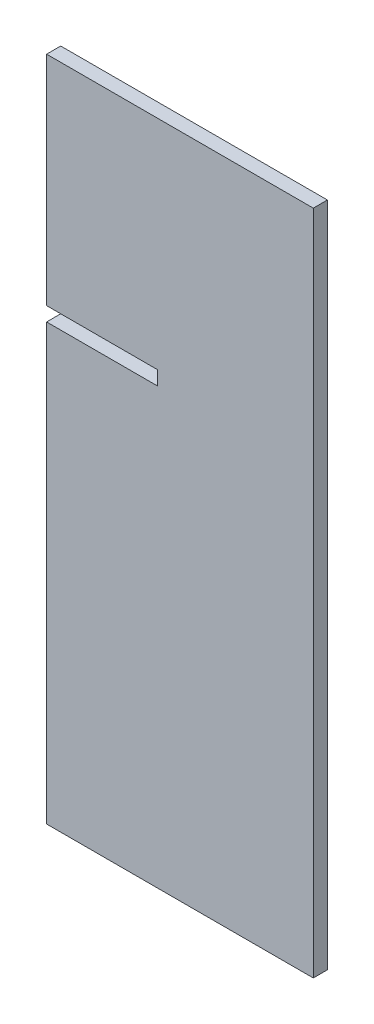
ISO-10303-21;
HEADER;
FILE_DESCRIPTION(('STEP AP214'),'2;1');
FILE_NAME('part.step','',(''),(''),'','','');
FILE_SCHEMA(('AUTOMOTIVE_DESIGN { 1 0 10303 214 1 1 1 1 }'));
ENDSEC;
DATA;
#1=APPLICATION_CONTEXT('core data for automotive mechanical design processes');
#2=APPLICATION_PROTOCOL_DEFINITION('international standard','automotive_design',2000,#1);
#3=PRODUCT_CONTEXT('',#1,'mechanical');
#4=PRODUCT('Part','Part','',(#3));
#5=PRODUCT_RELATED_PRODUCT_CATEGORY('part','',(#4));
#6=PRODUCT_DEFINITION_FORMATION('','',#4);
#7=PRODUCT_DEFINITION_CONTEXT('part definition',#1,'design');
#8=PRODUCT_DEFINITION('design','',#6,#7);
#9=PRODUCT_DEFINITION_SHAPE('','',#8);
#10=(LENGTH_UNIT() NAMED_UNIT(*) SI_UNIT(.MILLI.,.METRE.));
#11=(NAMED_UNIT(*) PLANE_ANGLE_UNIT() SI_UNIT($,.RADIAN.));
#12=(NAMED_UNIT(*) SI_UNIT($,.STERADIAN.) SOLID_ANGLE_UNIT());
#13=UNCERTAINTY_MEASURE_WITH_UNIT(LENGTH_MEASURE(1.E-05),#10,'distance_accuracy_value','');
#14=(GEOMETRIC_REPRESENTATION_CONTEXT(3) GLOBAL_UNCERTAINTY_ASSIGNED_CONTEXT((#13)) GLOBAL_UNIT_ASSIGNED_CONTEXT((#10,
#11,#12)) REPRESENTATION_CONTEXT('',''));
#15=CARTESIAN_POINT('',(0.,0.,0.));
#16=DIRECTION('',(0.,0.,1.));
#17=DIRECTION('',(1.,0.,0.));
#18=AXIS2_PLACEMENT_3D('',#15,#16,#17);
#19=CARTESIAN_POINT('',(-30.,75.,3.175));
#20=DIRECTION('',(1.,0.,0.));
#21=DIRECTION('',(0.,1.,0.));
#22=AXIS2_PLACEMENT_3D('',#19,#20,#21);
#23=PLANE('',#22);
#24=DIRECTION('',(0.,-1.,0.));
#25=VECTOR('',#24,1.);
#26=CARTESIAN_POINT('',(-30.,75.,0.));
#27=LINE('',#26,#25);
#28=CARTESIAN_POINT('',(-30.,75.,0.));
#29=VERTEX_POINT('',#28);
#30=CARTESIAN_POINT('',(-30.,26.,0.));
#31=VERTEX_POINT('',#30);
#32=EDGE_CURVE('E131',#29,#31,#27,.T.);
#33=ORIENTED_EDGE('',*,*,#32,.T.);
#34=DIRECTION('',(0.,0.,1.));
#35=VECTOR('',#34,1.);
#36=CARTESIAN_POINT('',(-30.,26.,0.));
#37=LINE('',#36,#35);
#38=CARTESIAN_POINT('',(-30.,26.,3.175));
#39=VERTEX_POINT('',#38);
#40=EDGE_CURVE('E163',#31,#39,#37,.T.);
#41=ORIENTED_EDGE('',*,*,#40,.T.);
#42=DIRECTION('',(0.,-1.,0.));
#43=VECTOR('',#42,1.);
#44=CARTESIAN_POINT('',(-30.,75.,3.175));
#45=LINE('',#44,#43);
#46=CARTESIAN_POINT('',(-30.,75.,3.175));
#47=VERTEX_POINT('',#46);
#48=EDGE_CURVE('E150',#47,#39,#45,.T.);
#49=ORIENTED_EDGE('',*,*,#48,.F.);
#50=DIRECTION('',(0.,0.,-1.));
#51=VECTOR('',#50,1.);
#52=CARTESIAN_POINT('',(-30.,75.,3.175));
#53=LINE('',#52,#51);
#54=EDGE_CURVE('E45',#47,#29,#53,.T.);
#55=ORIENTED_EDGE('',*,*,#54,.T.);
#56=EDGE_LOOP('',(#33,#41,#49,#55));
#57=FACE_BOUND('',#56,.T.);
#58=ADVANCED_FACE('F37',(#57),#23,.F.);
#59=CARTESIAN_POINT('',(30.,75.,3.175));
#60=DIRECTION('',(-1.,0.,0.));
#61=DIRECTION('',(0.,-1.,0.));
#62=AXIS2_PLACEMENT_3D('',#59,#60,#61);
#63=PLANE('',#62);
#64=DIRECTION('',(0.,1.,0.));
#65=VECTOR('',#64,1.);
#66=CARTESIAN_POINT('',(30.,75.,0.));
#67=LINE('',#66,#65);
#68=CARTESIAN_POINT('',(30.,-75.,0.));
#69=VERTEX_POINT('',#68);
#70=CARTESIAN_POINT('',(30.,75.,0.));
#71=VERTEX_POINT('',#70);
#72=EDGE_CURVE('E135',#69,#71,#67,.T.);
#73=ORIENTED_EDGE('',*,*,#72,.T.);
#74=DIRECTION('',(0.,0.,-1.));
#75=VECTOR('',#74,1.);
#76=CARTESIAN_POINT('',(30.,75.,3.175));
#77=LINE('',#76,#75);
#78=CARTESIAN_POINT('',(30.,75.,3.175));
#79=VERTEX_POINT('',#78);
#80=EDGE_CURVE('E11',#79,#71,#77,.T.);
#81=ORIENTED_EDGE('',*,*,#80,.F.);
#82=DIRECTION('',(0.,1.,0.));
#83=VECTOR('',#82,1.);
#84=CARTESIAN_POINT('',(30.,75.,3.175));
#85=LINE('',#84,#83);
#86=CARTESIAN_POINT('',(30.,-75.,3.175));
#87=VERTEX_POINT('',#86);
#88=EDGE_CURVE('E140',#87,#79,#85,.T.);
#89=ORIENTED_EDGE('',*,*,#88,.F.);
#90=DIRECTION('',(0.,0.,-1.));
#91=VECTOR('',#90,1.);
#92=CARTESIAN_POINT('',(30.,-75.,3.175));
#93=LINE('',#92,#91);
#94=EDGE_CURVE('E141',#87,#69,#93,.T.);
#95=ORIENTED_EDGE('',*,*,#94,.T.);
#96=EDGE_LOOP('',(#73,#81,#89,#95));
#97=FACE_BOUND('',#96,.T.);
#98=ADVANCED_FACE('F39',(#97),#63,.F.);
#99=CARTESIAN_POINT('',(-30.,75.,3.175));
#100=DIRECTION('',(0.,-1.,0.));
#101=DIRECTION('',(0.,0.,-1.));
#102=AXIS2_PLACEMENT_3D('',#99,#100,#101);
#103=PLANE('',#102);
#104=DIRECTION('',(-1.,0.,0.));
#105=VECTOR('',#104,1.);
#106=CARTESIAN_POINT('',(-30.,75.,0.));
#107=LINE('',#106,#105);
#108=EDGE_CURVE('E132',#71,#29,#107,.T.);
#109=ORIENTED_EDGE('',*,*,#108,.T.);
#110=ORIENTED_EDGE('',*,*,#54,.F.);
#111=DIRECTION('',(-1.,0.,0.));
#112=VECTOR('',#111,1.);
#113=CARTESIAN_POINT('',(-30.,75.,3.175));
#114=LINE('',#113,#112);
#115=EDGE_CURVE('E89',#79,#47,#114,.T.);
#116=ORIENTED_EDGE('',*,*,#115,.F.);
#117=ORIENTED_EDGE('',*,*,#80,.T.);
#118=EDGE_LOOP('',(#109,#110,#116,#117));
#119=FACE_BOUND('',#118,.T.);
#120=ADVANCED_FACE('F184',(#119),#103,.F.);
#121=CARTESIAN_POINT('',(-30.,22.825,3.175));
#122=VERTEX_POINT('',#121);
#123=CARTESIAN_POINT('',(-30.,-75.,3.175));
#124=VERTEX_POINT('',#123);
#125=EDGE_CURVE('E126',#122,#124,#45,.T.);
#126=ORIENTED_EDGE('',*,*,#125,.F.);
#127=DIRECTION('',(0.,0.,1.));
#128=VECTOR('',#127,1.);
#129=CARTESIAN_POINT('',(-30.,22.825,0.));
#130=LINE('',#129,#128);
#131=CARTESIAN_POINT('',(-30.,22.825,0.));
#132=VERTEX_POINT('',#131);
#133=EDGE_CURVE('E114',#132,#122,#130,.T.);
#134=ORIENTED_EDGE('',*,*,#133,.F.);
#135=CARTESIAN_POINT('',(-30.,-75.,0.));
#136=VERTEX_POINT('',#135);
#137=EDGE_CURVE('E125',#132,#136,#27,.T.);
#138=ORIENTED_EDGE('',*,*,#137,.T.);
#139=DIRECTION('',(0.,0.,-1.));
#140=VECTOR('',#139,1.);
#141=CARTESIAN_POINT('',(-30.,-75.,3.175));
#142=LINE('',#141,#140);
#143=EDGE_CURVE('E143',#124,#136,#142,.T.);
#144=ORIENTED_EDGE('',*,*,#143,.F.);
#145=EDGE_LOOP('',(#126,#134,#138,#144));
#146=FACE_BOUND('',#145,.T.);
#147=ADVANCED_FACE('F123',(#146),#23,.F.);
#148=CARTESIAN_POINT('',(-30.,-75.,3.175));
#149=DIRECTION('',(0.,1.,0.));
#150=DIRECTION('',(0.,0.,1.));
#151=AXIS2_PLACEMENT_3D('',#148,#149,#150);
#152=PLANE('',#151);
#153=DIRECTION('',(1.,0.,0.));
#154=VECTOR('',#153,1.);
#155=CARTESIAN_POINT('',(-30.,-75.,0.));
#156=LINE('',#155,#154);
#157=EDGE_CURVE('E82',#136,#69,#156,.T.);
#158=ORIENTED_EDGE('',*,*,#157,.T.);
#159=ORIENTED_EDGE('',*,*,#94,.F.);
#160=DIRECTION('',(1.,0.,0.));
#161=VECTOR('',#160,1.);
#162=CARTESIAN_POINT('',(-30.,-75.,3.175));
#163=LINE('',#162,#161);
#164=EDGE_CURVE('E61',#124,#87,#163,.T.);
#165=ORIENTED_EDGE('',*,*,#164,.F.);
#166=ORIENTED_EDGE('',*,*,#143,.T.);
#167=EDGE_LOOP('',(#158,#159,#165,#166));
#168=FACE_BOUND('',#167,.T.);
#169=ADVANCED_FACE('F175',(#168),#152,.F.);
#170=CARTESIAN_POINT('',(0.,0.,3.175));
#171=DIRECTION('',(0.,0.,1.));
#172=DIRECTION('',(1.,0.,0.));
#173=AXIS2_PLACEMENT_3D('',#170,#171,#172);
#174=PLANE('',#173);
#175=DIRECTION('',(-1.,0.,0.));
#176=VECTOR('',#175,1.);
#177=CARTESIAN_POINT('',(-30.,26.,3.175));
#178=LINE('',#177,#176);
#179=CARTESIAN_POINT('',(-5.,26.,3.175));
#180=VERTEX_POINT('',#179);
#181=EDGE_CURVE('E119',#180,#39,#178,.T.);
#182=ORIENTED_EDGE('',*,*,#181,.F.);
#183=DIRECTION('',(0.,1.,0.));
#184=VECTOR('',#183,1.);
#185=CARTESIAN_POINT('',(-5.,26.,3.175));
#186=LINE('',#185,#184);
#187=CARTESIAN_POINT('',(-5.,22.825,3.175));
#188=VERTEX_POINT('',#187);
#189=EDGE_CURVE('E159',#188,#180,#186,.T.);
#190=ORIENTED_EDGE('',*,*,#189,.F.);
#191=DIRECTION('',(1.,0.,0.));
#192=VECTOR('',#191,1.);
#193=CARTESIAN_POINT('',(-30.,22.825,3.175));
#194=LINE('',#193,#192);
#195=EDGE_CURVE('E157',#122,#188,#194,.T.);
#196=ORIENTED_EDGE('',*,*,#195,.F.);
#197=ORIENTED_EDGE('',*,*,#125,.T.);
#198=ORIENTED_EDGE('',*,*,#164,.T.);
#199=ORIENTED_EDGE('',*,*,#88,.T.);
#200=ORIENTED_EDGE('',*,*,#115,.T.);
#201=ORIENTED_EDGE('',*,*,#48,.T.);
#202=EDGE_LOOP('',(#182,#190,#196,#197,#198,#199,#200,#201));
#203=FACE_BOUND('',#202,.T.);
#204=ADVANCED_FACE('F177',(#203),#174,.T.);
#205=CARTESIAN_POINT('',(0.,0.,0.));
#206=DIRECTION('',(0.,0.,1.));
#207=DIRECTION('',(1.,0.,0.));
#208=AXIS2_PLACEMENT_3D('',#205,#206,#207);
#209=PLANE('',#208);
#210=DIRECTION('',(0.,1.,0.));
#211=VECTOR('',#210,1.);
#212=CARTESIAN_POINT('',(-5.,26.,0.));
#213=LINE('',#212,#211);
#214=CARTESIAN_POINT('',(-5.,22.825,0.));
#215=VERTEX_POINT('',#214);
#216=CARTESIAN_POINT('',(-5.,26.,0.));
#217=VERTEX_POINT('',#216);
#218=EDGE_CURVE('E52',#215,#217,#213,.T.);
#219=ORIENTED_EDGE('',*,*,#218,.T.);
#220=DIRECTION('',(-1.,0.,0.));
#221=VECTOR('',#220,1.);
#222=CARTESIAN_POINT('',(-30.,26.,0.));
#223=LINE('',#222,#221);
#224=EDGE_CURVE('E127',#217,#31,#223,.T.);
#225=ORIENTED_EDGE('',*,*,#224,.T.);
#226=ORIENTED_EDGE('',*,*,#32,.F.);
#227=ORIENTED_EDGE('',*,*,#108,.F.);
#228=ORIENTED_EDGE('',*,*,#72,.F.);
#229=ORIENTED_EDGE('',*,*,#157,.F.);
#230=ORIENTED_EDGE('',*,*,#137,.F.);
#231=DIRECTION('',(1.,0.,0.));
#232=VECTOR('',#231,1.);
#233=CARTESIAN_POINT('',(-30.,22.825,0.));
#234=LINE('',#233,#232);
#235=EDGE_CURVE('E110',#132,#215,#234,.T.);
#236=ORIENTED_EDGE('',*,*,#235,.T.);
#237=EDGE_LOOP('',(#219,#225,#226,#227,#228,#229,#230,#236));
#238=FACE_BOUND('',#237,.T.);
#239=ADVANCED_FACE('F129',(#238),#209,.F.);
#240=CARTESIAN_POINT('',(-30.,26.,0.));
#241=DIRECTION('',(0.,1.,0.));
#242=DIRECTION('',(0.,0.,1.));
#243=AXIS2_PLACEMENT_3D('',#240,#241,#242);
#244=PLANE('',#243);
#245=ORIENTED_EDGE('',*,*,#181,.T.);
#246=ORIENTED_EDGE('',*,*,#40,.F.);
#247=ORIENTED_EDGE('',*,*,#224,.F.);
#248=DIRECTION('',(0.,0.,1.));
#249=VECTOR('',#248,1.);
#250=CARTESIAN_POINT('',(-5.,26.,0.));
#251=LINE('',#250,#249);
#252=EDGE_CURVE('E165',#217,#180,#251,.T.);
#253=ORIENTED_EDGE('',*,*,#252,.T.);
#254=EDGE_LOOP('',(#245,#246,#247,#253));
#255=FACE_BOUND('',#254,.T.);
#256=ADVANCED_FACE('F220',(#255),#244,.F.);
#257=CARTESIAN_POINT('',(-5.,26.,0.));
#258=DIRECTION('',(1.,0.,0.));
#259=DIRECTION('',(0.,0.,-1.));
#260=AXIS2_PLACEMENT_3D('',#257,#258,#259);
#261=PLANE('',#260);
#262=ORIENTED_EDGE('',*,*,#189,.T.);
#263=ORIENTED_EDGE('',*,*,#252,.F.);
#264=ORIENTED_EDGE('',*,*,#218,.F.);
#265=DIRECTION('',(0.,0.,1.));
#266=VECTOR('',#265,1.);
#267=CARTESIAN_POINT('',(-5.,22.825,0.));
#268=LINE('',#267,#266);
#269=EDGE_CURVE('E116',#215,#188,#268,.T.);
#270=ORIENTED_EDGE('',*,*,#269,.T.);
#271=EDGE_LOOP('',(#262,#263,#264,#270));
#272=FACE_BOUND('',#271,.T.);
#273=ADVANCED_FACE('F230',(#272),#261,.F.);
#274=CARTESIAN_POINT('',(-30.,22.825,0.));
#275=DIRECTION('',(0.,-1.,0.));
#276=DIRECTION('',(0.,0.,-1.));
#277=AXIS2_PLACEMENT_3D('',#274,#275,#276);
#278=PLANE('',#277);
#279=ORIENTED_EDGE('',*,*,#195,.T.);
#280=ORIENTED_EDGE('',*,*,#269,.F.);
#281=ORIENTED_EDGE('',*,*,#235,.F.);
#282=ORIENTED_EDGE('',*,*,#133,.T.);
#283=EDGE_LOOP('',(#279,#280,#281,#282));
#284=FACE_BOUND('',#283,.T.);
#285=ADVANCED_FACE('F113',(#284),#278,.F.);
#286=CLOSED_SHELL('',(#58,#98,#120,#147,#169,#204,#239,#256,#273,#285));
#287=MANIFOLD_SOLID_BREP('B2',#286);
#288=ADVANCED_BREP_SHAPE_REPRESENTATION('',(#18,#287),#14);
#289=SHAPE_DEFINITION_REPRESENTATION(#9,#288);
ENDSEC;
END-ISO-10303-21;
